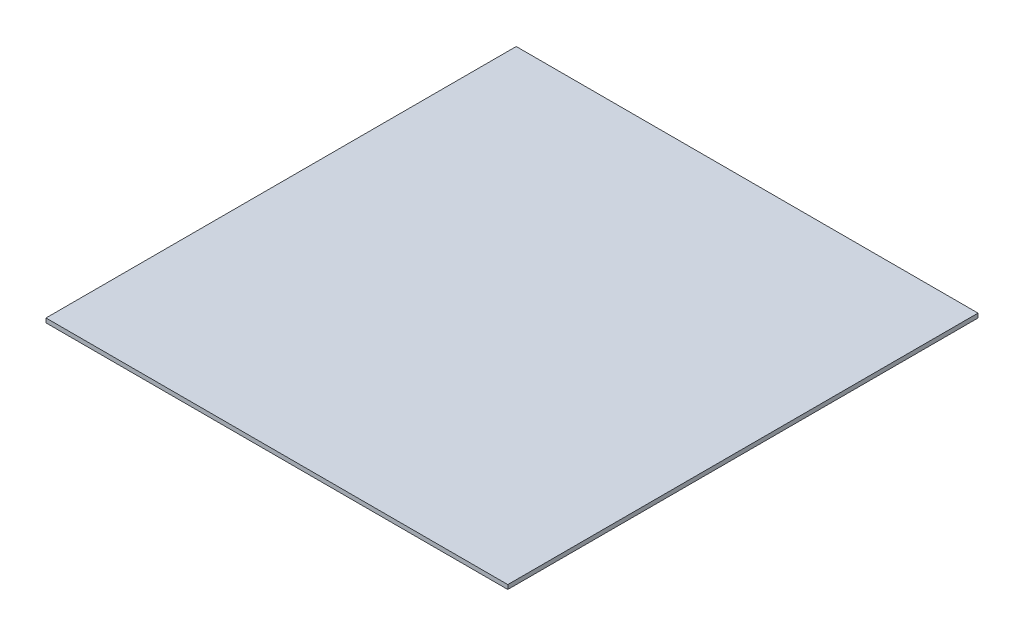
ISO-10303-21;
HEADER;
FILE_DESCRIPTION(('STEP AP214'),'2;1');
FILE_NAME('part.step','',(''),(''),'','','');
FILE_SCHEMA(('AUTOMOTIVE_DESIGN { 1 0 10303 214 1 1 1 1 }'));
ENDSEC;
DATA;
#1=APPLICATION_CONTEXT('core data for automotive mechanical design processes');
#2=APPLICATION_PROTOCOL_DEFINITION('international standard','automotive_design',2000,#1);
#3=PRODUCT_CONTEXT('',#1,'mechanical');
#4=PRODUCT('Part','Part','',(#3));
#5=PRODUCT_RELATED_PRODUCT_CATEGORY('part','',(#4));
#6=PRODUCT_DEFINITION_FORMATION('','',#4);
#7=PRODUCT_DEFINITION_CONTEXT('part definition',#1,'design');
#8=PRODUCT_DEFINITION('design','',#6,#7);
#9=PRODUCT_DEFINITION_SHAPE('','',#8);
#10=(LENGTH_UNIT() NAMED_UNIT(*) SI_UNIT(.MILLI.,.METRE.));
#11=(NAMED_UNIT(*) PLANE_ANGLE_UNIT() SI_UNIT($,.RADIAN.));
#12=(NAMED_UNIT(*) SI_UNIT($,.STERADIAN.) SOLID_ANGLE_UNIT());
#13=UNCERTAINTY_MEASURE_WITH_UNIT(LENGTH_MEASURE(1.E-05),#10,'distance_accuracy_value','');
#14=(GEOMETRIC_REPRESENTATION_CONTEXT(3) GLOBAL_UNCERTAINTY_ASSIGNED_CONTEXT((#13)) GLOBAL_UNIT_ASSIGNED_CONTEXT((#10,
#11,#12)) REPRESENTATION_CONTEXT('',''));
#15=CARTESIAN_POINT('',(0.,0.,0.));
#16=DIRECTION('',(0.,0.,1.));
#17=DIRECTION('',(1.,0.,0.));
#18=AXIS2_PLACEMENT_3D('',#15,#16,#17);
#19=CARTESIAN_POINT('',(0.,25.4,1390.44750632987));
#20=DIRECTION('',(1.,0.,0.));
#21=DIRECTION('',(0.,0.,-1.));
#22=AXIS2_PLACEMENT_3D('',#19,#20,#21);
#23=PLANE('',#22);
#24=DIRECTION('',(0.,0.,1.));
#25=VECTOR('',#24,1.);
#26=CARTESIAN_POINT('',(0.,0.,1390.44750632987));
#27=LINE('',#26,#25);
#28=CARTESIAN_POINT('',(0.,0.,-1399.55249367013));
#29=VERTEX_POINT('',#28);
#30=CARTESIAN_POINT('',(0.,0.,1390.44750632987));
#31=VERTEX_POINT('',#30);
#32=EDGE_CURVE('E96',#29,#31,#27,.T.);
#33=ORIENTED_EDGE('',*,*,#32,.T.);
#34=DIRECTION('',(0.,-1.,0.));
#35=VECTOR('',#34,1.);
#36=CARTESIAN_POINT('',(0.,25.4,1390.44750632987));
#37=LINE('',#36,#35);
#38=CARTESIAN_POINT('',(0.,25.4,1390.44750632987));
#39=VERTEX_POINT('',#38);
#40=EDGE_CURVE('E11',#39,#31,#37,.T.);
#41=ORIENTED_EDGE('',*,*,#40,.F.);
#42=DIRECTION('',(0.,0.,1.));
#43=VECTOR('',#42,1.);
#44=CARTESIAN_POINT('',(0.,25.4,1390.44750632987));
#45=LINE('',#44,#43);
#46=CARTESIAN_POINT('',(0.,25.4,-1399.55249367013));
#47=VERTEX_POINT('',#46);
#48=EDGE_CURVE('E84',#47,#39,#45,.T.);
#49=ORIENTED_EDGE('',*,*,#48,.F.);
#50=DIRECTION('',(0.,-1.,0.));
#51=VECTOR('',#50,1.);
#52=CARTESIAN_POINT('',(0.,25.4,-1399.55249367013));
#53=LINE('',#52,#51);
#54=EDGE_CURVE('E92',#47,#29,#53,.T.);
#55=ORIENTED_EDGE('',*,*,#54,.T.);
#56=EDGE_LOOP('',(#33,#41,#49,#55));
#57=FACE_BOUND('',#56,.T.);
#58=ADVANCED_FACE('F33',(#57),#23,.F.);
#59=CARTESIAN_POINT('',(0.,25.4,1390.44750632987));
#60=DIRECTION('',(0.,0.,-1.));
#61=DIRECTION('',(-1.,0.,0.));
#62=AXIS2_PLACEMENT_3D('',#59,#60,#61);
#63=PLANE('',#62);
#64=DIRECTION('',(1.,0.,0.));
#65=VECTOR('',#64,1.);
#66=CARTESIAN_POINT('',(0.,0.,1390.44750632987));
#67=LINE('',#66,#65);
#68=CARTESIAN_POINT('',(2740.,0.,1390.44750632987));
#69=VERTEX_POINT('',#68);
#70=EDGE_CURVE('E88',#31,#69,#67,.T.);
#71=ORIENTED_EDGE('',*,*,#70,.T.);
#72=DIRECTION('',(0.,-1.,0.));
#73=VECTOR('',#72,1.);
#74=CARTESIAN_POINT('',(2740.,25.4,1390.44750632987));
#75=LINE('',#74,#73);
#76=CARTESIAN_POINT('',(2740.,25.4,1390.44750632987));
#77=VERTEX_POINT('',#76);
#78=EDGE_CURVE('E41',#77,#69,#75,.T.);
#79=ORIENTED_EDGE('',*,*,#78,.F.);
#80=DIRECTION('',(1.,0.,0.));
#81=VECTOR('',#80,1.);
#82=CARTESIAN_POINT('',(0.,25.4,1390.44750632987));
#83=LINE('',#82,#81);
#84=EDGE_CURVE('E79',#39,#77,#83,.T.);
#85=ORIENTED_EDGE('',*,*,#84,.F.);
#86=ORIENTED_EDGE('',*,*,#40,.T.);
#87=EDGE_LOOP('',(#71,#79,#85,#86));
#88=FACE_BOUND('',#87,.T.);
#89=ADVANCED_FACE('F87',(#88),#63,.F.);
#90=CARTESIAN_POINT('',(2740.,25.4,1390.44750632987));
#91=DIRECTION('',(-1.,0.,0.));
#92=DIRECTION('',(0.,0.,1.));
#93=AXIS2_PLACEMENT_3D('',#90,#91,#92);
#94=PLANE('',#93);
#95=DIRECTION('',(0.,0.,-1.));
#96=VECTOR('',#95,1.);
#97=CARTESIAN_POINT('',(2740.,0.,1390.44750632987));
#98=LINE('',#97,#96);
#99=CARTESIAN_POINT('',(2740.,0.,-1399.55249367013));
#100=VERTEX_POINT('',#99);
#101=EDGE_CURVE('E66',#69,#100,#98,.T.);
#102=ORIENTED_EDGE('',*,*,#101,.T.);
#103=DIRECTION('',(0.,-1.,0.));
#104=VECTOR('',#103,1.);
#105=CARTESIAN_POINT('',(2740.,25.4,-1399.55249367013));
#106=LINE('',#105,#104);
#107=CARTESIAN_POINT('',(2740.,25.4,-1399.55249367013));
#108=VERTEX_POINT('',#107);
#109=EDGE_CURVE('E89',#108,#100,#106,.T.);
#110=ORIENTED_EDGE('',*,*,#109,.F.);
#111=DIRECTION('',(0.,0.,-1.));
#112=VECTOR('',#111,1.);
#113=CARTESIAN_POINT('',(2740.,25.4,1390.44750632987));
#114=LINE('',#113,#112);
#115=EDGE_CURVE('E82',#77,#108,#114,.T.);
#116=ORIENTED_EDGE('',*,*,#115,.F.);
#117=ORIENTED_EDGE('',*,*,#78,.T.);
#118=EDGE_LOOP('',(#102,#110,#116,#117));
#119=FACE_BOUND('',#118,.T.);
#120=ADVANCED_FACE('F90',(#119),#94,.F.);
#121=CARTESIAN_POINT('',(0.,25.4,-1399.55249367013));
#122=DIRECTION('',(0.,0.,1.));
#123=DIRECTION('',(1.,0.,0.));
#124=AXIS2_PLACEMENT_3D('',#121,#122,#123);
#125=PLANE('',#124);
#126=DIRECTION('',(-1.,0.,0.));
#127=VECTOR('',#126,1.);
#128=CARTESIAN_POINT('',(0.,0.,-1399.55249367013));
#129=LINE('',#128,#127);
#130=EDGE_CURVE('E72',#100,#29,#129,.T.);
#131=ORIENTED_EDGE('',*,*,#130,.T.);
#132=ORIENTED_EDGE('',*,*,#54,.F.);
#133=DIRECTION('',(-1.,0.,0.));
#134=VECTOR('',#133,1.);
#135=CARTESIAN_POINT('',(0.,25.4,-1399.55249367013));
#136=LINE('',#135,#134);
#137=EDGE_CURVE('E49',#108,#47,#136,.T.);
#138=ORIENTED_EDGE('',*,*,#137,.F.);
#139=ORIENTED_EDGE('',*,*,#109,.T.);
#140=EDGE_LOOP('',(#131,#132,#138,#139));
#141=FACE_BOUND('',#140,.T.);
#142=ADVANCED_FACE('F103',(#141),#125,.F.);
#143=CARTESIAN_POINT('',(0.,25.4,-1399.55249367013));
#144=DIRECTION('',(0.,-1.,0.));
#145=DIRECTION('',(0.,0.,-1.));
#146=AXIS2_PLACEMENT_3D('',#143,#144,#145);
#147=PLANE('',#146);
#148=ORIENTED_EDGE('',*,*,#48,.T.);
#149=ORIENTED_EDGE('',*,*,#84,.T.);
#150=ORIENTED_EDGE('',*,*,#115,.T.);
#151=ORIENTED_EDGE('',*,*,#137,.T.);
#152=EDGE_LOOP('',(#148,#149,#150,#151));
#153=FACE_BOUND('',#152,.T.);
#154=ADVANCED_FACE('F80',(#153),#147,.F.);
#155=CARTESIAN_POINT('',(0.,0.,-1399.55249367013));
#156=DIRECTION('',(0.,-1.,0.));
#157=DIRECTION('',(0.,0.,-1.));
#158=AXIS2_PLACEMENT_3D('',#155,#156,#157);
#159=PLANE('',#158);
#160=ORIENTED_EDGE('',*,*,#32,.F.);
#161=ORIENTED_EDGE('',*,*,#130,.F.);
#162=ORIENTED_EDGE('',*,*,#101,.F.);
#163=ORIENTED_EDGE('',*,*,#70,.F.);
#164=EDGE_LOOP('',(#160,#161,#162,#163));
#165=FACE_BOUND('',#164,.T.);
#166=ADVANCED_FACE('F106',(#165),#159,.T.);
#167=CLOSED_SHELL('',(#58,#89,#120,#142,#154,#166));
#168=MANIFOLD_SOLID_BREP('B2',#167);
#169=ADVANCED_BREP_SHAPE_REPRESENTATION('',(#18,#168),#14);
#170=SHAPE_DEFINITION_REPRESENTATION(#9,#169);
ENDSEC;
END-ISO-10303-21;
